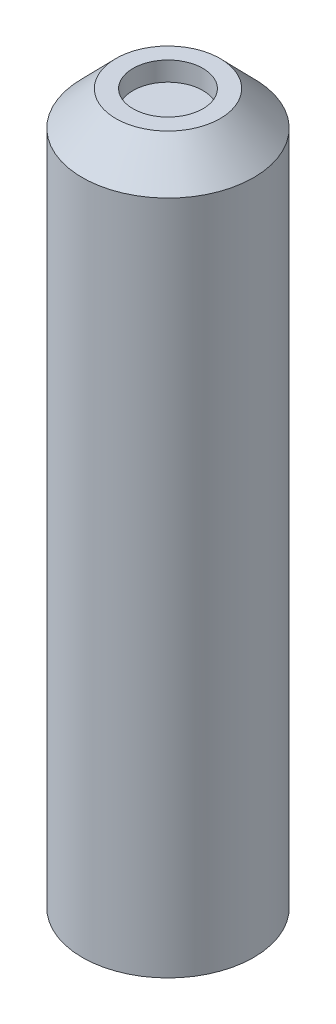
ISO-10303-21;
HEADER;
FILE_DESCRIPTION(('STEP AP214'),'2;1');
FILE_NAME('part.step','',(''),(''),'','','');
FILE_SCHEMA(('AUTOMOTIVE_DESIGN { 1 0 10303 214 1 1 1 1 }'));
ENDSEC;
DATA;
#1=APPLICATION_CONTEXT('core data for automotive mechanical design processes');
#2=APPLICATION_PROTOCOL_DEFINITION('international standard','automotive_design',2000,#1);
#3=PRODUCT_CONTEXT('',#1,'mechanical');
#4=PRODUCT('Part','Part','',(#3));
#5=PRODUCT_RELATED_PRODUCT_CATEGORY('part','',(#4));
#6=PRODUCT_DEFINITION_FORMATION('','',#4);
#7=PRODUCT_DEFINITION_CONTEXT('part definition',#1,'design');
#8=PRODUCT_DEFINITION('design','',#6,#7);
#9=PRODUCT_DEFINITION_SHAPE('','',#8);
#10=(LENGTH_UNIT() NAMED_UNIT(*) SI_UNIT(.MILLI.,.METRE.));
#11=(NAMED_UNIT(*) PLANE_ANGLE_UNIT() SI_UNIT($,.RADIAN.));
#12=(NAMED_UNIT(*) SI_UNIT($,.STERADIAN.) SOLID_ANGLE_UNIT());
#13=UNCERTAINTY_MEASURE_WITH_UNIT(LENGTH_MEASURE(1.E-05),#10,'distance_accuracy_value','');
#14=(GEOMETRIC_REPRESENTATION_CONTEXT(3) GLOBAL_UNCERTAINTY_ASSIGNED_CONTEXT((#13)) GLOBAL_UNIT_ASSIGNED_CONTEXT((#10,
#11,#12)) REPRESENTATION_CONTEXT('',''));
#15=CARTESIAN_POINT('',(0.,0.,0.));
#16=DIRECTION('',(0.,0.,1.));
#17=DIRECTION('',(1.,0.,0.));
#18=AXIS2_PLACEMENT_3D('',#15,#16,#17);
#19=CARTESIAN_POINT('',(0.,103.5,0.));
#20=DIRECTION('',(0.,-1.,0.));
#21=DIRECTION('',(0.,0.,-1.));
#22=AXIS2_PLACEMENT_3D('',#19,#20,#21);
#23=CYLINDRICAL_SURFACE('',#22,12.5);
#24=CARTESIAN_POINT('',(0.,0.,0.));
#25=DIRECTION('',(0.,1.,0.));
#26=DIRECTION('',(0.,0.,1.));
#27=AXIS2_PLACEMENT_3D('',#24,#25,#26);
#28=CIRCLE('',#27,12.5);
#29=CARTESIAN_POINT('',(0.,0.,12.5));
#30=VERTEX_POINT('',#29);
#31=EDGE_CURVE('E10',#30,#30,#28,.T.);
#32=ORIENTED_EDGE('',*,*,#31,.T.);
#33=EDGE_LOOP('',(#32));
#34=FACE_BOUND('',#33,.T.);
#35=CARTESIAN_POINT('',(0.,98.5,0.));
#36=DIRECTION('',(0.,-1.,0.));
#37=DIRECTION('',(1.,0.,0.));
#38=AXIS2_PLACEMENT_3D('',#35,#36,#37);
#39=CIRCLE('',#38,12.5);
#40=CARTESIAN_POINT('',(12.5,98.5,0.));
#41=VERTEX_POINT('',#40);
#42=EDGE_CURVE('E50',#41,#41,#39,.T.);
#43=ORIENTED_EDGE('',*,*,#42,.T.);
#44=EDGE_LOOP('',(#43));
#45=FACE_BOUND('',#44,.T.);
#46=ADVANCED_FACE('F43',(#34,#45),#23,.T.);
#47=CARTESIAN_POINT('',(0.,0.,0.));
#48=DIRECTION('',(0.,1.,0.));
#49=DIRECTION('',(0.,0.,1.));
#50=AXIS2_PLACEMENT_3D('',#47,#48,#49);
#51=PLANE('',#50);
#52=CARTESIAN_POINT('',(0.,0.,0.));
#53=DIRECTION('',(0.,-1.,0.));
#54=DIRECTION('',(0.,0.,-1.));
#55=AXIS2_PLACEMENT_3D('',#52,#53,#54);
#56=CIRCLE('',#55,4.25);
#57=CARTESIAN_POINT('',(0.,0.,-4.25));
#58=VERTEX_POINT('',#57);
#59=EDGE_CURVE('E71',#58,#58,#56,.T.);
#60=ORIENTED_EDGE('',*,*,#59,.F.);
#61=EDGE_LOOP('',(#60));
#62=FACE_BOUND('',#61,.T.);
#63=ORIENTED_EDGE('',*,*,#31,.F.);
#64=EDGE_LOOP('',(#63));
#65=FACE_BOUND('',#64,.T.);
#66=ADVANCED_FACE('F88',(#62,#65),#51,.F.);
#67=CARTESIAN_POINT('',(0.,98.5,0.));
#68=DIRECTION('',(0.,-1.,0.));
#69=DIRECTION('',(1.,0.,0.));
#70=AXIS2_PLACEMENT_3D('',#67,#68,#69);
#71=CONICAL_SURFACE('',#70,12.5,0.77519337331036);
#72=CARTESIAN_POINT('',(0.,103.5,0.));
#73=DIRECTION('',(0.,-1.,0.));
#74=DIRECTION('',(1.,0.,0.));
#75=AXIS2_PLACEMENT_3D('',#72,#73,#74);
#76=CIRCLE('',#75,7.60102051443365);
#77=CARTESIAN_POINT('',(7.60102051443365,103.5,0.));
#78=VERTEX_POINT('',#77);
#79=EDGE_CURVE('E55',#78,#78,#76,.T.);
#80=ORIENTED_EDGE('',*,*,#79,.T.);
#81=EDGE_LOOP('',(#80));
#82=FACE_BOUND('',#81,.T.);
#83=ORIENTED_EDGE('',*,*,#42,.F.);
#84=EDGE_LOOP('',(#83));
#85=FACE_BOUND('',#84,.T.);
#86=ADVANCED_FACE('F91',(#82,#85),#71,.T.);
#87=CARTESIAN_POINT('',(0.,103.5,0.));
#88=DIRECTION('',(0.,1.,0.));
#89=DIRECTION('',(0.,0.,1.));
#90=AXIS2_PLACEMENT_3D('',#87,#88,#89);
#91=PLANE('',#90);
#92=CARTESIAN_POINT('',(0.,103.5,0.));
#93=DIRECTION('',(0.,1.,0.));
#94=DIRECTION('',(0.,0.,1.));
#95=AXIS2_PLACEMENT_3D('',#92,#93,#94);
#96=CIRCLE('',#95,5.10102051443365);
#97=CARTESIAN_POINT('',(0.,103.5,5.10102051443365));
#98=VERTEX_POINT('',#97);
#99=EDGE_CURVE('E63',#98,#98,#96,.T.);
#100=ORIENTED_EDGE('',*,*,#99,.F.);
#101=EDGE_LOOP('',(#100));
#102=FACE_BOUND('',#101,.T.);
#103=ORIENTED_EDGE('',*,*,#79,.F.);
#104=EDGE_LOOP('',(#103));
#105=FACE_BOUND('',#104,.T.);
#106=ADVANCED_FACE('F96',(#102,#105),#91,.T.);
#107=CARTESIAN_POINT('',(0.,100.7,0.));
#108=DIRECTION('',(0.,1.,0.));
#109=DIRECTION('',(0.,0.,1.));
#110=AXIS2_PLACEMENT_3D('',#107,#108,#109);
#111=CYLINDRICAL_SURFACE('',#110,5.10102051443365);
#112=CARTESIAN_POINT('',(0.,100.7,0.));
#113=DIRECTION('',(0.,1.,0.));
#114=DIRECTION('',(0.,0.,1.));
#115=AXIS2_PLACEMENT_3D('',#112,#113,#114);
#116=CIRCLE('',#115,5.10102051443365);
#117=CARTESIAN_POINT('',(0.,100.7,5.10102051443365));
#118=VERTEX_POINT('',#117);
#119=EDGE_CURVE('E60',#118,#118,#116,.T.);
#120=ORIENTED_EDGE('',*,*,#119,.F.);
#121=EDGE_LOOP('',(#120));
#122=FACE_BOUND('',#121,.T.);
#123=ORIENTED_EDGE('',*,*,#99,.T.);
#124=EDGE_LOOP('',(#123));
#125=FACE_BOUND('',#124,.T.);
#126=ADVANCED_FACE('F102',(#122,#125),#111,.F.);
#127=CARTESIAN_POINT('',(0.,100.7,0.));
#128=DIRECTION('',(0.,1.,0.));
#129=DIRECTION('',(0.,0.,1.));
#130=AXIS2_PLACEMENT_3D('',#127,#128,#129);
#131=PLANE('',#130);
#132=ORIENTED_EDGE('',*,*,#119,.T.);
#133=EDGE_LOOP('',(#132));
#134=FACE_BOUND('',#133,.T.);
#135=ADVANCED_FACE('F84',(#134),#131,.T.);
#136=CARTESIAN_POINT('',(0.,9.5,0.));
#137=DIRECTION('',(0.,-1.,0.));
#138=DIRECTION('',(0.,0.,-1.));
#139=AXIS2_PLACEMENT_3D('',#136,#137,#138);
#140=CYLINDRICAL_SURFACE('',#139,4.25);
#141=CARTESIAN_POINT('',(0.,9.5,0.));
#142=DIRECTION('',(0.,-1.,0.));
#143=DIRECTION('',(0.,0.,-1.));
#144=AXIS2_PLACEMENT_3D('',#141,#142,#143);
#145=CIRCLE('',#144,4.25);
#146=CARTESIAN_POINT('',(0.,9.5,-4.25));
#147=VERTEX_POINT('',#146);
#148=EDGE_CURVE('E67',#147,#147,#145,.T.);
#149=ORIENTED_EDGE('',*,*,#148,.F.);
#150=EDGE_LOOP('',(#149));
#151=FACE_BOUND('',#150,.T.);
#152=ORIENTED_EDGE('',*,*,#59,.T.);
#153=EDGE_LOOP('',(#152));
#154=FACE_BOUND('',#153,.T.);
#155=ADVANCED_FACE('F81',(#151,#154),#140,.F.);
#156=CARTESIAN_POINT('',(0.,9.5,0.));
#157=DIRECTION('',(0.,-1.,0.));
#158=DIRECTION('',(0.,0.,-1.));
#159=AXIS2_PLACEMENT_3D('',#156,#157,#158);
#160=PLANE('',#159);
#161=ORIENTED_EDGE('',*,*,#148,.T.);
#162=EDGE_LOOP('',(#161));
#163=FACE_BOUND('',#162,.T.);
#164=ADVANCED_FACE('F79',(#163),#160,.T.);
#165=CLOSED_SHELL('',(#46,#66,#86,#106,#126,#135,#155,#164));
#166=MANIFOLD_SOLID_BREP('B2',#165);
#167=ADVANCED_BREP_SHAPE_REPRESENTATION('',(#18,#166),#14);
#168=SHAPE_DEFINITION_REPRESENTATION(#9,#167);
ENDSEC;
END-ISO-10303-21;
